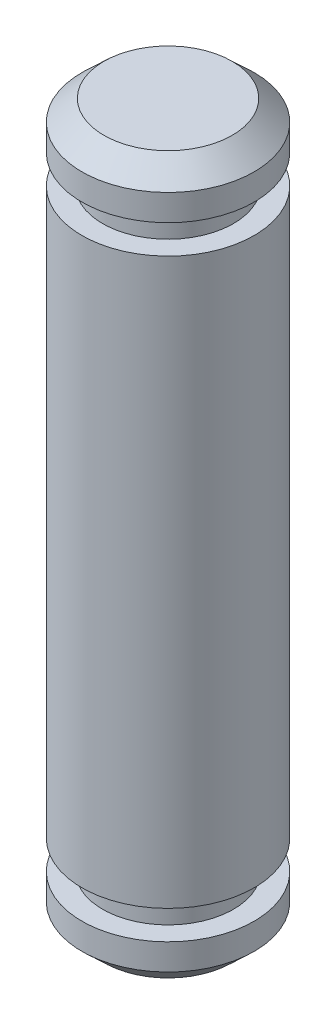
ISO-10303-21;
HEADER;
FILE_DESCRIPTION(('STEP AP214'),'2;1');
FILE_NAME('part.step','',(''),(''),'','','');
FILE_SCHEMA(('AUTOMOTIVE_DESIGN { 1 0 10303 214 1 1 1 1 }'));
ENDSEC;
DATA;
#1=APPLICATION_CONTEXT('core data for automotive mechanical design processes');
#2=APPLICATION_PROTOCOL_DEFINITION('international standard','automotive_design',2000,#1);
#3=PRODUCT_CONTEXT('',#1,'mechanical');
#4=PRODUCT('Part','Part','',(#3));
#5=PRODUCT_RELATED_PRODUCT_CATEGORY('part','',(#4));
#6=PRODUCT_DEFINITION_FORMATION('','',#4);
#7=PRODUCT_DEFINITION_CONTEXT('part definition',#1,'design');
#8=PRODUCT_DEFINITION('design','',#6,#7);
#9=PRODUCT_DEFINITION_SHAPE('','',#8);
#10=(LENGTH_UNIT() NAMED_UNIT(*) SI_UNIT(.MILLI.,.METRE.));
#11=(NAMED_UNIT(*) PLANE_ANGLE_UNIT() SI_UNIT($,.RADIAN.));
#12=(NAMED_UNIT(*) SI_UNIT($,.STERADIAN.) SOLID_ANGLE_UNIT());
#13=UNCERTAINTY_MEASURE_WITH_UNIT(LENGTH_MEASURE(1.E-05),#10,'distance_accuracy_value','');
#14=(GEOMETRIC_REPRESENTATION_CONTEXT(3) GLOBAL_UNCERTAINTY_ASSIGNED_CONTEXT((#13)) GLOBAL_UNIT_ASSIGNED_CONTEXT((#10,
#11,#12)) REPRESENTATION_CONTEXT('',''));
#15=CARTESIAN_POINT('',(0.,0.,0.));
#16=DIRECTION('',(0.,0.,1.));
#17=DIRECTION('',(1.,0.,0.));
#18=AXIS2_PLACEMENT_3D('',#15,#16,#17);
#19=CARTESIAN_POINT('',(-1.5875,5.207,0.));
#20=DIRECTION('',(0.,-1.,0.));
#21=DIRECTION('',(0.,0.,-1.));
#22=AXIS2_PLACEMENT_3D('',#19,#20,#21);
#23=PLANE('',#22);
#24=CARTESIAN_POINT('',(0.,5.207,0.));
#25=DIRECTION('',(0.,-1.,0.));
#26=DIRECTION('',(0.,0.,-1.));
#27=AXIS2_PLACEMENT_3D('',#24,#25,#26);
#28=CIRCLE('',#27,1.5875);
#29=CARTESIAN_POINT('',(0.,5.207,-1.5875));
#30=VERTEX_POINT('',#29);
#31=EDGE_CURVE('E12',#30,#30,#28,.T.);
#32=ORIENTED_EDGE('',*,*,#31,.F.);
#33=EDGE_LOOP('',(#32));
#34=FACE_BOUND('',#33,.T.);
#35=CARTESIAN_POINT('',(0.,5.207,0.));
#36=DIRECTION('',(0.,-1.,0.));
#37=DIRECTION('',(0.,0.,-1.));
#38=AXIS2_PLACEMENT_3D('',#35,#36,#37);
#39=CIRCLE('',#38,1.2065);
#40=CARTESIAN_POINT('',(0.,5.207,-1.2065));
#41=VERTEX_POINT('',#40);
#42=EDGE_CURVE('E80',#41,#41,#39,.T.);
#43=ORIENTED_EDGE('',*,*,#42,.T.);
#44=EDGE_LOOP('',(#43));
#45=FACE_BOUND('',#44,.T.);
#46=ADVANCED_FACE('F40',(#34,#45),#23,.F.);
#47=CARTESIAN_POINT('',(0.,0.,0.));
#48=DIRECTION('',(0.,-1.,0.));
#49=DIRECTION('',(0.,0.,-1.));
#50=AXIS2_PLACEMENT_3D('',#47,#48,#49);
#51=CYLINDRICAL_SURFACE('',#50,1.5875);
#52=CARTESIAN_POINT('',(0.,-5.207,0.));
#53=DIRECTION('',(0.,-1.,0.));
#54=DIRECTION('',(0.,0.,-1.));
#55=AXIS2_PLACEMENT_3D('',#52,#53,#54);
#56=CIRCLE('',#55,1.5875);
#57=CARTESIAN_POINT('',(0.,-5.207,-1.5875));
#58=VERTEX_POINT('',#57);
#59=EDGE_CURVE('E46',#58,#58,#56,.T.);
#60=ORIENTED_EDGE('',*,*,#59,.F.);
#61=EDGE_LOOP('',(#60));
#62=FACE_BOUND('',#61,.T.);
#63=ORIENTED_EDGE('',*,*,#31,.T.);
#64=EDGE_LOOP('',(#63));
#65=FACE_BOUND('',#64,.T.);
#66=ADVANCED_FACE('F120',(#62,#65),#51,.T.);
#67=CARTESIAN_POINT('',(-1.5875,-5.207,0.));
#68=DIRECTION('',(0.,1.,0.));
#69=DIRECTION('',(0.,0.,1.));
#70=AXIS2_PLACEMENT_3D('',#67,#68,#69);
#71=PLANE('',#70);
#72=CARTESIAN_POINT('',(0.,-5.207,0.));
#73=DIRECTION('',(0.,-1.,0.));
#74=DIRECTION('',(0.,0.,-1.));
#75=AXIS2_PLACEMENT_3D('',#72,#73,#74);
#76=CIRCLE('',#75,1.2065);
#77=CARTESIAN_POINT('',(0.,-5.207,-1.2065));
#78=VERTEX_POINT('',#77);
#79=EDGE_CURVE('E50',#78,#78,#76,.T.);
#80=ORIENTED_EDGE('',*,*,#79,.F.);
#81=EDGE_LOOP('',(#80));
#82=FACE_BOUND('',#81,.T.);
#83=ORIENTED_EDGE('',*,*,#59,.T.);
#84=EDGE_LOOP('',(#83));
#85=FACE_BOUND('',#84,.T.);
#86=ADVANCED_FACE('F125',(#82,#85),#71,.F.);
#87=CARTESIAN_POINT('',(0.,0.,0.));
#88=DIRECTION('',(0.,-1.,0.));
#89=DIRECTION('',(0.,0.,-1.));
#90=AXIS2_PLACEMENT_3D('',#87,#88,#89);
#91=CYLINDRICAL_SURFACE('',#90,1.2065);
#92=CARTESIAN_POINT('',(0.,-5.7404,0.));
#93=DIRECTION('',(0.,-1.,0.));
#94=DIRECTION('',(0.,0.,-1.));
#95=AXIS2_PLACEMENT_3D('',#92,#93,#94);
#96=CIRCLE('',#95,1.2065);
#97=CARTESIAN_POINT('',(0.,-5.7404,-1.2065));
#98=VERTEX_POINT('',#97);
#99=EDGE_CURVE('E54',#98,#98,#96,.T.);
#100=ORIENTED_EDGE('',*,*,#99,.F.);
#101=EDGE_LOOP('',(#100));
#102=FACE_BOUND('',#101,.T.);
#103=ORIENTED_EDGE('',*,*,#79,.T.);
#104=EDGE_LOOP('',(#103));
#105=FACE_BOUND('',#104,.T.);
#106=ADVANCED_FACE('F130',(#102,#105),#91,.T.);
#107=CARTESIAN_POINT('',(-1.2065,-5.7404,0.));
#108=DIRECTION('',(0.,-1.,0.));
#109=DIRECTION('',(0.,0.,-1.));
#110=AXIS2_PLACEMENT_3D('',#107,#108,#109);
#111=PLANE('',#110);
#112=CARTESIAN_POINT('',(0.,-5.7404,0.));
#113=DIRECTION('',(0.,-1.,0.));
#114=DIRECTION('',(0.,0.,-1.));
#115=AXIS2_PLACEMENT_3D('',#112,#113,#114);
#116=CIRCLE('',#115,1.5875);
#117=CARTESIAN_POINT('',(0.,-5.7404,-1.5875));
#118=VERTEX_POINT('',#117);
#119=EDGE_CURVE('E59',#118,#118,#116,.T.);
#120=ORIENTED_EDGE('',*,*,#119,.F.);
#121=EDGE_LOOP('',(#120));
#122=FACE_BOUND('',#121,.T.);
#123=ORIENTED_EDGE('',*,*,#99,.T.);
#124=EDGE_LOOP('',(#123));
#125=FACE_BOUND('',#124,.T.);
#126=ADVANCED_FACE('F136',(#122,#125),#111,.F.);
#127=CARTESIAN_POINT('',(0.,0.,0.));
#128=DIRECTION('',(0.,-1.,0.));
#129=DIRECTION('',(0.,0.,-1.));
#130=AXIS2_PLACEMENT_3D('',#127,#128,#129);
#131=CYLINDRICAL_SURFACE('',#130,1.5875);
#132=CARTESIAN_POINT('',(0.,-6.223,0.));
#133=DIRECTION('',(0.,-1.,0.));
#134=DIRECTION('',(0.,0.,-1.));
#135=AXIS2_PLACEMENT_3D('',#132,#133,#134);
#136=CIRCLE('',#135,1.5875);
#137=CARTESIAN_POINT('',(0.,-6.223,-1.5875));
#138=VERTEX_POINT('',#137);
#139=EDGE_CURVE('E62',#138,#138,#136,.T.);
#140=ORIENTED_EDGE('',*,*,#139,.F.);
#141=EDGE_LOOP('',(#140));
#142=FACE_BOUND('',#141,.T.);
#143=ORIENTED_EDGE('',*,*,#119,.T.);
#144=EDGE_LOOP('',(#143));
#145=FACE_BOUND('',#144,.T.);
#146=ADVANCED_FACE('F140',(#142,#145),#131,.T.);
#147=CARTESIAN_POINT('',(0.,-6.223,0.));
#148=DIRECTION('',(0.,1.,0.));
#149=DIRECTION('',(0.,0.,1.));
#150=AXIS2_PLACEMENT_3D('',#147,#148,#149);
#151=CONICAL_SURFACE('',#150,1.5875,0.815568544068997);
#152=CARTESIAN_POINT('',(0.,-6.604,0.));
#153=DIRECTION('',(0.,-1.,0.));
#154=DIRECTION('',(0.,0.,-1.));
#155=AXIS2_PLACEMENT_3D('',#152,#153,#154);
#156=CIRCLE('',#155,1.18278756142947);
#157=CARTESIAN_POINT('',(0.,-6.604,-1.18278756142947));
#158=VERTEX_POINT('',#157);
#159=EDGE_CURVE('E65',#158,#158,#156,.T.);
#160=ORIENTED_EDGE('',*,*,#159,.F.);
#161=EDGE_LOOP('',(#160));
#162=FACE_BOUND('',#161,.T.);
#163=ORIENTED_EDGE('',*,*,#139,.T.);
#164=EDGE_LOOP('',(#163));
#165=FACE_BOUND('',#164,.T.);
#166=ADVANCED_FACE('F116',(#162,#165),#151,.T.);
#167=CARTESIAN_POINT('',(-1.18278756142947,-6.604,0.));
#168=DIRECTION('',(0.,1.,0.));
#169=DIRECTION('',(0.,0.,1.));
#170=AXIS2_PLACEMENT_3D('',#167,#168,#169);
#171=PLANE('',#170);
#172=ORIENTED_EDGE('',*,*,#159,.T.);
#173=EDGE_LOOP('',(#172));
#174=FACE_BOUND('',#173,.T.);
#175=ADVANCED_FACE('F111',(#174),#171,.F.);
#176=CARTESIAN_POINT('',(-1.18278756142947,6.604,0.));
#177=DIRECTION('',(0.,-1.,0.));
#178=DIRECTION('',(0.,0.,-1.));
#179=AXIS2_PLACEMENT_3D('',#176,#177,#178);
#180=PLANE('',#179);
#181=CARTESIAN_POINT('',(0.,6.604,0.));
#182=DIRECTION('',(0.,-1.,0.));
#183=DIRECTION('',(0.,0.,-1.));
#184=AXIS2_PLACEMENT_3D('',#181,#182,#183);
#185=CIRCLE('',#184,1.18278756142947);
#186=CARTESIAN_POINT('',(0.,6.604,-1.18278756142947));
#187=VERTEX_POINT('',#186);
#188=EDGE_CURVE('E68',#187,#187,#185,.T.);
#189=ORIENTED_EDGE('',*,*,#188,.F.);
#190=EDGE_LOOP('',(#189));
#191=FACE_BOUND('',#190,.T.);
#192=ADVANCED_FACE('F106',(#191),#180,.F.);
#193=CARTESIAN_POINT('',(0.,6.604,0.));
#194=DIRECTION('',(0.,-1.,0.));
#195=DIRECTION('',(0.,0.,-1.));
#196=AXIS2_PLACEMENT_3D('',#193,#194,#195);
#197=CONICAL_SURFACE('',#196,1.18278756142947,0.815568544068997);
#198=CARTESIAN_POINT('',(0.,6.223,0.));
#199=DIRECTION('',(0.,-1.,0.));
#200=DIRECTION('',(0.,0.,-1.));
#201=AXIS2_PLACEMENT_3D('',#198,#199,#200);
#202=CIRCLE('',#201,1.5875);
#203=CARTESIAN_POINT('',(0.,6.223,-1.5875));
#204=VERTEX_POINT('',#203);
#205=EDGE_CURVE('E71',#204,#204,#202,.T.);
#206=ORIENTED_EDGE('',*,*,#205,.F.);
#207=EDGE_LOOP('',(#206));
#208=FACE_BOUND('',#207,.T.);
#209=ORIENTED_EDGE('',*,*,#188,.T.);
#210=EDGE_LOOP('',(#209));
#211=FACE_BOUND('',#210,.T.);
#212=ADVANCED_FACE('F100',(#208,#211),#197,.T.);
#213=CARTESIAN_POINT('',(0.,0.,0.));
#214=DIRECTION('',(0.,-1.,0.));
#215=DIRECTION('',(0.,0.,-1.));
#216=AXIS2_PLACEMENT_3D('',#213,#214,#215);
#217=CYLINDRICAL_SURFACE('',#216,1.5875);
#218=CARTESIAN_POINT('',(0.,5.7404,0.));
#219=DIRECTION('',(0.,-1.,0.));
#220=DIRECTION('',(0.,0.,-1.));
#221=AXIS2_PLACEMENT_3D('',#218,#219,#220);
#222=CIRCLE('',#221,1.5875);
#223=CARTESIAN_POINT('',(0.,5.7404,-1.5875));
#224=VERTEX_POINT('',#223);
#225=EDGE_CURVE('E74',#224,#224,#222,.T.);
#226=ORIENTED_EDGE('',*,*,#225,.F.);
#227=EDGE_LOOP('',(#226));
#228=FACE_BOUND('',#227,.T.);
#229=ORIENTED_EDGE('',*,*,#205,.T.);
#230=EDGE_LOOP('',(#229));
#231=FACE_BOUND('',#230,.T.);
#232=ADVANCED_FACE('F94',(#228,#231),#217,.T.);
#233=CARTESIAN_POINT('',(-1.2065,5.7404,0.));
#234=DIRECTION('',(0.,1.,0.));
#235=DIRECTION('',(0.,0.,1.));
#236=AXIS2_PLACEMENT_3D('',#233,#234,#235);
#237=PLANE('',#236);
#238=CARTESIAN_POINT('',(0.,5.7404,0.));
#239=DIRECTION('',(0.,-1.,0.));
#240=DIRECTION('',(0.,0.,-1.));
#241=AXIS2_PLACEMENT_3D('',#238,#239,#240);
#242=CIRCLE('',#241,1.2065);
#243=CARTESIAN_POINT('',(0.,5.7404,-1.2065));
#244=VERTEX_POINT('',#243);
#245=EDGE_CURVE('E77',#244,#244,#242,.T.);
#246=ORIENTED_EDGE('',*,*,#245,.F.);
#247=EDGE_LOOP('',(#246));
#248=FACE_BOUND('',#247,.T.);
#249=ORIENTED_EDGE('',*,*,#225,.T.);
#250=EDGE_LOOP('',(#249));
#251=FACE_BOUND('',#250,.T.);
#252=ADVANCED_FACE('F88',(#248,#251),#237,.F.);
#253=CARTESIAN_POINT('',(0.,0.,0.));
#254=DIRECTION('',(0.,-1.,0.));
#255=DIRECTION('',(0.,0.,-1.));
#256=AXIS2_PLACEMENT_3D('',#253,#254,#255);
#257=CYLINDRICAL_SURFACE('',#256,1.2065);
#258=ORIENTED_EDGE('',*,*,#42,.F.);
#259=EDGE_LOOP('',(#258));
#260=FACE_BOUND('',#259,.T.);
#261=ORIENTED_EDGE('',*,*,#245,.T.);
#262=EDGE_LOOP('',(#261));
#263=FACE_BOUND('',#262,.T.);
#264=ADVANCED_FACE('F85',(#260,#263),#257,.T.);
#265=CLOSED_SHELL('',(#46,#66,#86,#106,#126,#146,#166,#175,#192,#212,#232,#252,#264));
#266=MANIFOLD_SOLID_BREP('B2',#265);
#267=ADVANCED_BREP_SHAPE_REPRESENTATION('',(#18,#266),#14);
#268=SHAPE_DEFINITION_REPRESENTATION(#9,#267);
ENDSEC;
END-ISO-10303-21;
